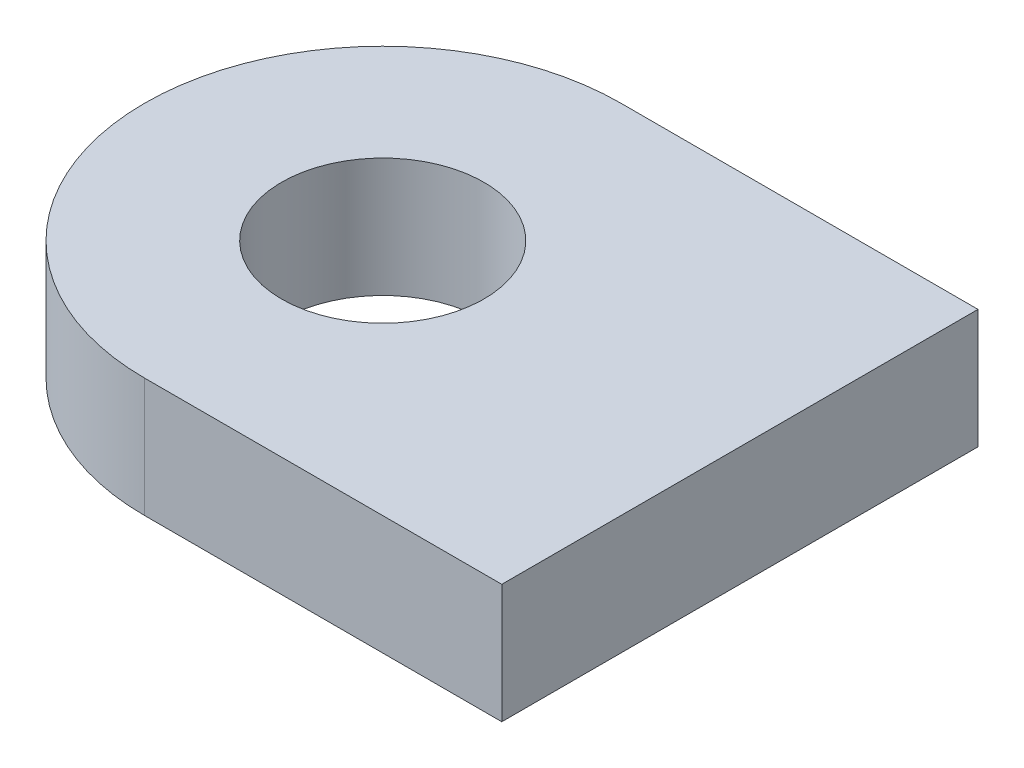
ISO-10303-21;
HEADER;
FILE_DESCRIPTION(('STEP AP214'),'2;1');
FILE_NAME('part.step','',(''),(''),'','','');
FILE_SCHEMA(('AUTOMOTIVE_DESIGN { 1 0 10303 214 1 1 1 1 }'));
ENDSEC;
DATA;
#1=APPLICATION_CONTEXT('core data for automotive mechanical design processes');
#2=APPLICATION_PROTOCOL_DEFINITION('international standard','automotive_design',2000,#1);
#3=PRODUCT_CONTEXT('',#1,'mechanical');
#4=PRODUCT('Part','Part','',(#3));
#5=PRODUCT_RELATED_PRODUCT_CATEGORY('part','',(#4));
#6=PRODUCT_DEFINITION_FORMATION('','',#4);
#7=PRODUCT_DEFINITION_CONTEXT('part definition',#1,'design');
#8=PRODUCT_DEFINITION('design','',#6,#7);
#9=PRODUCT_DEFINITION_SHAPE('','',#8);
#10=(LENGTH_UNIT() NAMED_UNIT(*) SI_UNIT(.MILLI.,.METRE.));
#11=(NAMED_UNIT(*) PLANE_ANGLE_UNIT() SI_UNIT($,.RADIAN.));
#12=(NAMED_UNIT(*) SI_UNIT($,.STERADIAN.) SOLID_ANGLE_UNIT());
#13=UNCERTAINTY_MEASURE_WITH_UNIT(LENGTH_MEASURE(1.E-05),#10,'distance_accuracy_value','');
#14=(GEOMETRIC_REPRESENTATION_CONTEXT(3) GLOBAL_UNCERTAINTY_ASSIGNED_CONTEXT((#13)) GLOBAL_UNIT_ASSIGNED_CONTEXT((#10,
#11,#12)) REPRESENTATION_CONTEXT('',''));
#15=CARTESIAN_POINT('',(0.,0.,0.));
#16=DIRECTION('',(0.,0.,1.));
#17=DIRECTION('',(1.,0.,0.));
#18=AXIS2_PLACEMENT_3D('',#15,#16,#17);
#19=CARTESIAN_POINT('',(-32.5,12.4999999999999,760.));
#20=DIRECTION('',(0.,1.,0.));
#21=DIRECTION('',(0.,0.,1.));
#22=AXIS2_PLACEMENT_3D('',#19,#20,#21);
#23=CYLINDRICAL_SURFACE('',#22,10.);
#24=CARTESIAN_POINT('',(-32.5,17.4999999999999,760.));
#25=DIRECTION('',(0.,1.,0.));
#26=DIRECTION('',(0.,0.,-1.));
#27=AXIS2_PLACEMENT_3D('',#24,#25,#26);
#28=CIRCLE('',#27,10.);
#29=CARTESIAN_POINT('',(-32.5,17.4999999999999,750.));
#30=VERTEX_POINT('',#29);
#31=CARTESIAN_POINT('',(-32.5,17.4999999999999,770.));
#32=VERTEX_POINT('',#31);
#33=EDGE_CURVE('E104',#30,#32,#28,.T.);
#34=ORIENTED_EDGE('',*,*,#33,.F.);
#35=DIRECTION('',(0.,1.,0.));
#36=VECTOR('',#35,1.);
#37=CARTESIAN_POINT('',(-32.5,12.4999999999999,750.));
#38=LINE('',#37,#36);
#39=CARTESIAN_POINT('',(-32.5,12.4999999999999,750.));
#40=VERTEX_POINT('',#39);
#41=EDGE_CURVE('E12',#40,#30,#38,.T.);
#42=ORIENTED_EDGE('',*,*,#41,.F.);
#43=CARTESIAN_POINT('',(-32.5,12.4999999999999,760.));
#44=DIRECTION('',(0.,1.,0.));
#45=DIRECTION('',(0.,0.,-1.));
#46=AXIS2_PLACEMENT_3D('',#43,#44,#45);
#47=CIRCLE('',#46,10.);
#48=CARTESIAN_POINT('',(-32.5,12.4999999999999,770.));
#49=VERTEX_POINT('',#48);
#50=EDGE_CURVE('E97',#40,#49,#47,.T.);
#51=ORIENTED_EDGE('',*,*,#50,.T.);
#52=DIRECTION('',(0.,1.,0.));
#53=VECTOR('',#52,1.);
#54=CARTESIAN_POINT('',(-32.5,12.4999999999999,770.));
#55=LINE('',#54,#53);
#56=EDGE_CURVE('E42',#49,#32,#55,.T.);
#57=ORIENTED_EDGE('',*,*,#56,.T.);
#58=EDGE_LOOP('',(#34,#42,#51,#57));
#59=FACE_BOUND('',#58,.T.);
#60=ADVANCED_FACE('F39',(#59),#23,.T.);
#61=CARTESIAN_POINT('',(-17.5,12.4999999999999,750.));
#62=DIRECTION('',(0.,0.,-1.));
#63=DIRECTION('',(0.,1.,0.));
#64=AXIS2_PLACEMENT_3D('',#61,#62,#63);
#65=PLANE('',#64);
#66=DIRECTION('',(-1.,0.,0.));
#67=VECTOR('',#66,1.);
#68=CARTESIAN_POINT('',(-17.5,17.4999999999999,750.));
#69=LINE('',#68,#67);
#70=CARTESIAN_POINT('',(-17.5,17.4999999999999,750.));
#71=VERTEX_POINT('',#70);
#72=EDGE_CURVE('E99',#71,#30,#69,.T.);
#73=ORIENTED_EDGE('',*,*,#72,.F.);
#74=DIRECTION('',(0.,1.,0.));
#75=VECTOR('',#74,1.);
#76=CARTESIAN_POINT('',(-17.5,12.4999999999999,750.));
#77=LINE('',#76,#75);
#78=CARTESIAN_POINT('',(-17.5,12.4999999999999,750.));
#79=VERTEX_POINT('',#78);
#80=EDGE_CURVE('E48',#79,#71,#77,.T.);
#81=ORIENTED_EDGE('',*,*,#80,.F.);
#82=DIRECTION('',(-1.,0.,0.));
#83=VECTOR('',#82,1.);
#84=CARTESIAN_POINT('',(-17.5,12.4999999999999,750.));
#85=LINE('',#84,#83);
#86=EDGE_CURVE('E94',#79,#40,#85,.T.);
#87=ORIENTED_EDGE('',*,*,#86,.T.);
#88=ORIENTED_EDGE('',*,*,#41,.T.);
#89=EDGE_LOOP('',(#73,#81,#87,#88));
#90=FACE_BOUND('',#89,.T.);
#91=ADVANCED_FACE('F121',(#90),#65,.T.);
#92=CARTESIAN_POINT('',(-17.5,12.4999999999999,750.));
#93=DIRECTION('',(1.,0.,0.));
#94=DIRECTION('',(0.,0.,-1.));
#95=AXIS2_PLACEMENT_3D('',#92,#93,#94);
#96=PLANE('',#95);
#97=DIRECTION('',(0.,0.,-1.));
#98=VECTOR('',#97,1.);
#99=CARTESIAN_POINT('',(-17.5,17.4999999999999,750.));
#100=LINE('',#99,#98);
#101=CARTESIAN_POINT('',(-17.5,17.4999999999999,770.));
#102=VERTEX_POINT('',#101);
#103=EDGE_CURVE('E89',#102,#71,#100,.T.);
#104=ORIENTED_EDGE('',*,*,#103,.F.);
#105=DIRECTION('',(0.,1.,0.));
#106=VECTOR('',#105,1.);
#107=CARTESIAN_POINT('',(-17.5,12.4999999999999,770.));
#108=LINE('',#107,#106);
#109=CARTESIAN_POINT('',(-17.5,12.4999999999999,770.));
#110=VERTEX_POINT('',#109);
#111=EDGE_CURVE('E84',#110,#102,#108,.T.);
#112=ORIENTED_EDGE('',*,*,#111,.F.);
#113=DIRECTION('',(0.,0.,-1.));
#114=VECTOR('',#113,1.);
#115=CARTESIAN_POINT('',(-17.5,12.4999999999999,750.));
#116=LINE('',#115,#114);
#117=EDGE_CURVE('E87',#110,#79,#116,.T.);
#118=ORIENTED_EDGE('',*,*,#117,.T.);
#119=ORIENTED_EDGE('',*,*,#80,.T.);
#120=EDGE_LOOP('',(#104,#112,#118,#119));
#121=FACE_BOUND('',#120,.T.);
#122=ADVANCED_FACE('F86',(#121),#96,.T.);
#123=CARTESIAN_POINT('',(-17.5,12.4999999999999,770.));
#124=DIRECTION('',(0.,0.,1.));
#125=DIRECTION('',(0.,-1.,0.));
#126=AXIS2_PLACEMENT_3D('',#123,#124,#125);
#127=PLANE('',#126);
#128=DIRECTION('',(1.,0.,0.));
#129=VECTOR('',#128,1.);
#130=CARTESIAN_POINT('',(-17.5,17.4999999999999,770.));
#131=LINE('',#130,#129);
#132=EDGE_CURVE('E108',#32,#102,#131,.T.);
#133=ORIENTED_EDGE('',*,*,#132,.F.);
#134=ORIENTED_EDGE('',*,*,#56,.F.);
#135=DIRECTION('',(1.,0.,0.));
#136=VECTOR('',#135,1.);
#137=CARTESIAN_POINT('',(-17.5,12.4999999999999,770.));
#138=LINE('',#137,#136);
#139=EDGE_CURVE('E93',#49,#110,#138,.T.);
#140=ORIENTED_EDGE('',*,*,#139,.T.);
#141=ORIENTED_EDGE('',*,*,#111,.T.);
#142=EDGE_LOOP('',(#133,#134,#140,#141));
#143=FACE_BOUND('',#142,.T.);
#144=ADVANCED_FACE('F96',(#143),#127,.T.);
#145=CARTESIAN_POINT('',(-32.5,12.4999999999999,760.));
#146=DIRECTION('',(0.,-1.,0.));
#147=DIRECTION('',(0.,0.,-1.));
#148=AXIS2_PLACEMENT_3D('',#145,#146,#147);
#149=PLANE('',#148);
#150=CARTESIAN_POINT('',(-32.5,12.4999999999999,760.));
#151=DIRECTION('',(0.,1.,0.));
#152=DIRECTION('',(0.,0.,1.));
#153=AXIS2_PLACEMENT_3D('',#150,#151,#152);
#154=CIRCLE('',#153,4.24999999999989);
#155=CARTESIAN_POINT('',(-32.5,12.4999999999999,764.25));
#156=VERTEX_POINT('',#155);
#157=EDGE_CURVE('E109',#156,#156,#154,.T.);
#158=ORIENTED_EDGE('',*,*,#157,.T.);
#159=EDGE_LOOP('',(#158));
#160=FACE_BOUND('',#159,.T.);
#161=ORIENTED_EDGE('',*,*,#50,.F.);
#162=ORIENTED_EDGE('',*,*,#86,.F.);
#163=ORIENTED_EDGE('',*,*,#117,.F.);
#164=ORIENTED_EDGE('',*,*,#139,.F.);
#165=EDGE_LOOP('',(#161,#162,#163,#164));
#166=FACE_BOUND('',#165,.T.);
#167=ADVANCED_FACE('F92',(#160,#166),#149,.T.);
#168=CARTESIAN_POINT('',(-32.5,17.4999999999999,760.));
#169=DIRECTION('',(0.,-1.,0.));
#170=DIRECTION('',(0.,0.,-1.));
#171=AXIS2_PLACEMENT_3D('',#168,#169,#170);
#172=PLANE('',#171);
#173=CARTESIAN_POINT('',(-32.5,17.4999999999999,760.));
#174=DIRECTION('',(0.,1.,0.));
#175=DIRECTION('',(0.,0.,1.));
#176=AXIS2_PLACEMENT_3D('',#173,#174,#175);
#177=CIRCLE('',#176,4.24999999999989);
#178=CARTESIAN_POINT('',(-32.5,17.4999999999999,764.25));
#179=VERTEX_POINT('',#178);
#180=EDGE_CURVE('E151',#179,#179,#177,.T.);
#181=ORIENTED_EDGE('',*,*,#180,.F.);
#182=EDGE_LOOP('',(#181));
#183=FACE_BOUND('',#182,.T.);
#184=ORIENTED_EDGE('',*,*,#33,.T.);
#185=ORIENTED_EDGE('',*,*,#132,.T.);
#186=ORIENTED_EDGE('',*,*,#103,.T.);
#187=ORIENTED_EDGE('',*,*,#72,.T.);
#188=EDGE_LOOP('',(#184,#185,#186,#187));
#189=FACE_BOUND('',#188,.T.);
#190=ADVANCED_FACE('F120',(#183,#189),#172,.F.);
#191=CARTESIAN_POINT('',(-32.5,12.4999999999999,760.));
#192=DIRECTION('',(0.,1.,0.));
#193=DIRECTION('',(0.,0.,1.));
#194=AXIS2_PLACEMENT_3D('',#191,#192,#193);
#195=CYLINDRICAL_SURFACE('',#194,4.24999999999989);
#196=ORIENTED_EDGE('',*,*,#157,.F.);
#197=EDGE_LOOP('',(#196));
#198=FACE_BOUND('',#197,.T.);
#199=ORIENTED_EDGE('',*,*,#180,.T.);
#200=EDGE_LOOP('',(#199));
#201=FACE_BOUND('',#200,.T.);
#202=ADVANCED_FACE('F139',(#198,#201),#195,.F.);
#203=CLOSED_SHELL('',(#60,#91,#122,#144,#167,#190,#202));
#204=MANIFOLD_SOLID_BREP('B2',#203);
#205=ADVANCED_BREP_SHAPE_REPRESENTATION('',(#18,#204),#14);
#206=SHAPE_DEFINITION_REPRESENTATION(#9,#205);
ENDSEC;
END-ISO-10303-21;
